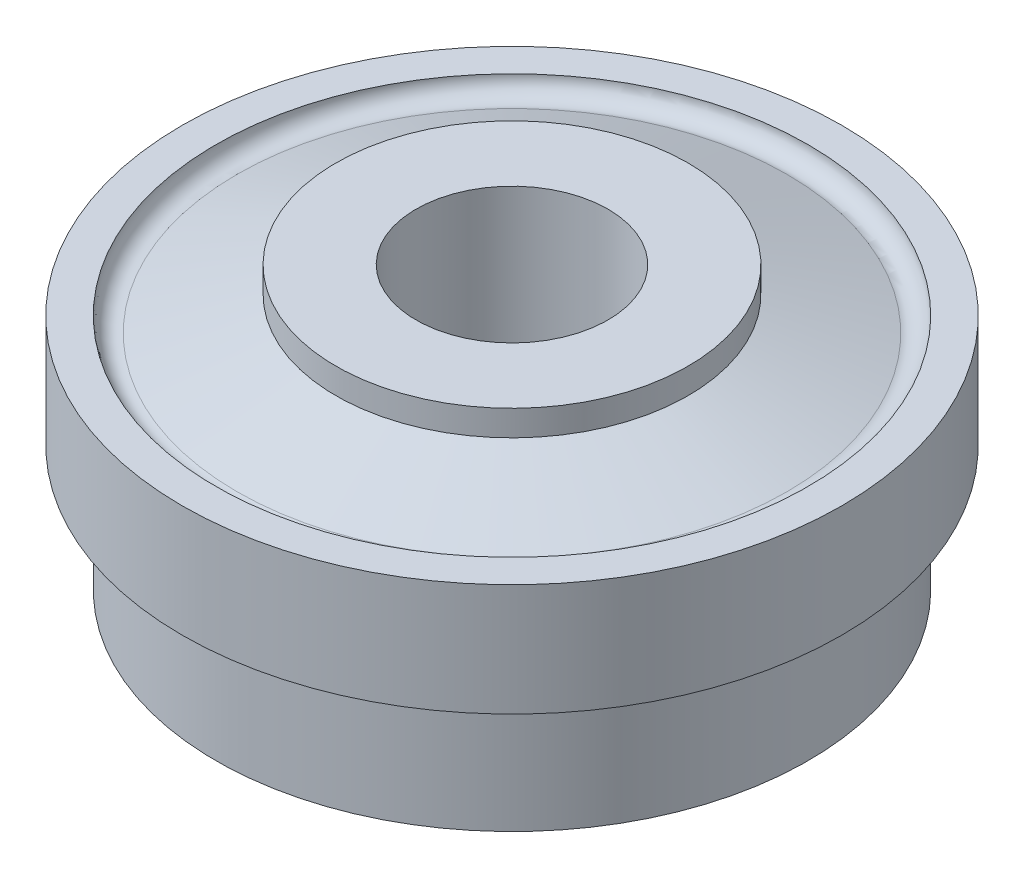
ISO-10303-21;
HEADER;
FILE_DESCRIPTION(('STEP AP214'),'2;1');
FILE_NAME('part.step','',(''),(''),'','','');
FILE_SCHEMA(('AUTOMOTIVE_DESIGN { 1 0 10303 214 1 1 1 1 }'));
ENDSEC;
DATA;
#1=APPLICATION_CONTEXT('core data for automotive mechanical design processes');
#2=APPLICATION_PROTOCOL_DEFINITION('international standard','automotive_design',2000,#1);
#3=PRODUCT_CONTEXT('',#1,'mechanical');
#4=PRODUCT('Part','Part','',(#3));
#5=PRODUCT_RELATED_PRODUCT_CATEGORY('part','',(#4));
#6=PRODUCT_DEFINITION_FORMATION('','',#4);
#7=PRODUCT_DEFINITION_CONTEXT('part definition',#1,'design');
#8=PRODUCT_DEFINITION('design','',#6,#7);
#9=PRODUCT_DEFINITION_SHAPE('','',#8);
#10=(LENGTH_UNIT() NAMED_UNIT(*) SI_UNIT(.MILLI.,.METRE.));
#11=(NAMED_UNIT(*) PLANE_ANGLE_UNIT() SI_UNIT($,.RADIAN.));
#12=(NAMED_UNIT(*) SI_UNIT($,.STERADIAN.) SOLID_ANGLE_UNIT());
#13=UNCERTAINTY_MEASURE_WITH_UNIT(LENGTH_MEASURE(1.E-05),#10,'distance_accuracy_value','');
#14=(GEOMETRIC_REPRESENTATION_CONTEXT(3) GLOBAL_UNCERTAINTY_ASSIGNED_CONTEXT((#13)) GLOBAL_UNIT_ASSIGNED_CONTEXT((#10,
#11,#12)) REPRESENTATION_CONTEXT('',''));
#15=CARTESIAN_POINT('',(0.,0.,0.));
#16=DIRECTION('',(0.,0.,1.));
#17=DIRECTION('',(1.,0.,0.));
#18=AXIS2_PLACEMENT_3D('',#15,#16,#17);
#19=CARTESIAN_POINT('',(0.,45.,0.));
#20=DIRECTION('',(0.,-1.,0.));
#21=DIRECTION('',(0.,0.,-1.));
#22=AXIS2_PLACEMENT_3D('',#19,#20,#21);
#23=TOROIDAL_SURFACE('',#22,61.,6.);
#24=CARTESIAN_POINT('',(0.,45.,0.));
#25=DIRECTION('',(0.,-1.,0.));
#26=DIRECTION('',(0.,0.,-1.));
#27=AXIS2_PLACEMENT_3D('',#24,#25,#26);
#28=CIRCLE('',#27,55.);
#29=CARTESIAN_POINT('',(0.,45.,-55.));
#30=VERTEX_POINT('',#29);
#31=EDGE_CURVE('E82',#30,#30,#28,.T.);
#32=ORIENTED_EDGE('',*,*,#31,.F.);
#33=EDGE_LOOP('',(#32));
#34=FACE_BOUND('',#33,.T.);
#35=CARTESIAN_POINT('',(0.,50.0374747900803,0.));
#36=DIRECTION('',(0.,-1.,0.));
#37=DIRECTION('',(0.,0.,-1.));
#38=AXIS2_PLACEMENT_3D('',#35,#36,#37);
#39=CIRCLE('',#38,64.2594244490869);
#40=CARTESIAN_POINT('',(0.,50.0374747900803,-64.2594244490869));
#41=VERTEX_POINT('',#40);
#42=EDGE_CURVE('E10',#41,#41,#39,.T.);
#43=ORIENTED_EDGE('',*,*,#42,.T.);
#44=EDGE_LOOP('',(#43));
#45=FACE_BOUND('',#44,.T.);
#46=ADVANCED_FACE('F33',(#34,#45),#23,.F.);
#47=CARTESIAN_POINT('',(0.,50.0374747900803,0.));
#48=DIRECTION('',(0.,-1.,0.));
#49=DIRECTION('',(0.,0.,-1.));
#50=AXIS2_PLACEMENT_3D('',#47,#48,#49);
#51=CONICAL_SURFACE('',#50,64.2594244490869,0.996508016861981);
#52=CARTESIAN_POINT('',(0.,35.,0.));
#53=DIRECTION('',(0.,-1.,0.));
#54=DIRECTION('',(0.,0.,-1.));
#55=AXIS2_PLACEMENT_3D('',#52,#53,#54);
#56=CIRCLE('',#55,87.5);
#57=CARTESIAN_POINT('',(0.,35.,-87.5));
#58=VERTEX_POINT('',#57);
#59=EDGE_CURVE('E39',#58,#58,#56,.T.);
#60=ORIENTED_EDGE('',*,*,#59,.T.);
#61=EDGE_LOOP('',(#60));
#62=FACE_BOUND('',#61,.T.);
#63=ORIENTED_EDGE('',*,*,#42,.F.);
#64=EDGE_LOOP('',(#63));
#65=FACE_BOUND('',#64,.T.);
#66=ADVANCED_FACE('F90',(#62,#65),#51,.F.);
#67=CARTESIAN_POINT('',(0.,-19.7924492059413,0.));
#68=DIRECTION('',(0.,-1.,0.));
#69=DIRECTION('',(0.,0.,-1.));
#70=AXIS2_PLACEMENT_3D('',#67,#68,#69);
#71=CYLINDRICAL_SURFACE('',#70,87.5);
#72=CARTESIAN_POINT('',(0.,-12.,0.));
#73=DIRECTION('',(0.,-1.,0.));
#74=DIRECTION('',(0.,0.,-1.));
#75=AXIS2_PLACEMENT_3D('',#72,#73,#74);
#76=CIRCLE('',#75,87.5);
#77=CARTESIAN_POINT('',(0.,-12.,-87.5));
#78=VERTEX_POINT('',#77);
#79=EDGE_CURVE('E43',#78,#78,#76,.T.);
#80=ORIENTED_EDGE('',*,*,#79,.T.);
#81=EDGE_LOOP('',(#80));
#82=FACE_BOUND('',#81,.T.);
#83=ORIENTED_EDGE('',*,*,#59,.F.);
#84=EDGE_LOOP('',(#83));
#85=FACE_BOUND('',#84,.T.);
#86=ADVANCED_FACE('F94',(#82,#85),#71,.F.);
#87=CARTESIAN_POINT('',(0.,-12.,0.));
#88=DIRECTION('',(0.,-1.,0.));
#89=DIRECTION('',(0.,0.,-1.));
#90=AXIS2_PLACEMENT_3D('',#87,#88,#89);
#91=PLANE('',#90);
#92=CARTESIAN_POINT('',(0.,-12.,0.));
#93=DIRECTION('',(0.,-1.,0.));
#94=DIRECTION('',(0.,0.,-1.));
#95=AXIS2_PLACEMENT_3D('',#92,#93,#94);
#96=CIRCLE('',#95,92.5);
#97=CARTESIAN_POINT('',(0.,-12.,-92.5));
#98=VERTEX_POINT('',#97);
#99=EDGE_CURVE('E47',#98,#98,#96,.T.);
#100=ORIENTED_EDGE('',*,*,#99,.T.);
#101=EDGE_LOOP('',(#100));
#102=FACE_BOUND('',#101,.T.);
#103=ORIENTED_EDGE('',*,*,#79,.F.);
#104=EDGE_LOOP('',(#103));
#105=FACE_BOUND('',#104,.T.);
#106=ADVANCED_FACE('F98',(#102,#105),#91,.T.);
#107=CARTESIAN_POINT('',(0.,-19.7924492059413,0.));
#108=DIRECTION('',(0.,-1.,0.));
#109=DIRECTION('',(0.,0.,-1.));
#110=AXIS2_PLACEMENT_3D('',#107,#108,#109);
#111=CYLINDRICAL_SURFACE('',#110,92.5);
#112=CARTESIAN_POINT('',(0.,27.2064154989765,0.));
#113=DIRECTION('',(0.,-1.,0.));
#114=DIRECTION('',(0.,0.,-1.));
#115=AXIS2_PLACEMENT_3D('',#112,#113,#114);
#116=CIRCLE('',#115,92.5);
#117=CARTESIAN_POINT('',(0.,27.2064154989765,-92.5));
#118=VERTEX_POINT('',#117);
#119=EDGE_CURVE('E52',#118,#118,#116,.T.);
#120=ORIENTED_EDGE('',*,*,#119,.T.);
#121=EDGE_LOOP('',(#120));
#122=FACE_BOUND('',#121,.T.);
#123=ORIENTED_EDGE('',*,*,#99,.F.);
#124=EDGE_LOOP('',(#123));
#125=FACE_BOUND('',#124,.T.);
#126=ADVANCED_FACE('F105',(#122,#125),#111,.T.);
#127=CARTESIAN_POINT('',(0.,27.2064154989765,0.));
#128=DIRECTION('',(0.,-1.,0.));
#129=DIRECTION('',(0.,0.,-1.));
#130=AXIS2_PLACEMENT_3D('',#127,#128,#129);
#131=PLANE('',#130);
#132=CARTESIAN_POINT('',(0.,27.2064154989765,0.));
#133=DIRECTION('',(0.,-1.,0.));
#134=DIRECTION('',(0.,0.,-1.));
#135=AXIS2_PLACEMENT_3D('',#132,#133,#134);
#136=CIRCLE('',#135,103.);
#137=CARTESIAN_POINT('',(0.,27.2064154989765,-103.));
#138=VERTEX_POINT('',#137);
#139=EDGE_CURVE('E55',#138,#138,#136,.T.);
#140=ORIENTED_EDGE('',*,*,#139,.T.);
#141=EDGE_LOOP('',(#140));
#142=FACE_BOUND('',#141,.T.);
#143=ORIENTED_EDGE('',*,*,#119,.F.);
#144=EDGE_LOOP('',(#143));
#145=FACE_BOUND('',#144,.T.);
#146=ADVANCED_FACE('F109',(#142,#145),#131,.T.);
#147=CARTESIAN_POINT('',(0.,-19.7924492059413,0.));
#148=DIRECTION('',(0.,-1.,0.));
#149=DIRECTION('',(0.,0.,-1.));
#150=AXIS2_PLACEMENT_3D('',#147,#148,#149);
#151=CYLINDRICAL_SURFACE('',#150,103.);
#152=CARTESIAN_POINT('',(0.,62.2064154989765,0.));
#153=DIRECTION('',(0.,-1.,0.));
#154=DIRECTION('',(0.,0.,-1.));
#155=AXIS2_PLACEMENT_3D('',#152,#153,#154);
#156=CIRCLE('',#155,103.);
#157=CARTESIAN_POINT('',(0.,62.2064154989765,-103.));
#158=VERTEX_POINT('',#157);
#159=EDGE_CURVE('E58',#158,#158,#156,.T.);
#160=ORIENTED_EDGE('',*,*,#159,.T.);
#161=EDGE_LOOP('',(#160));
#162=FACE_BOUND('',#161,.T.);
#163=ORIENTED_EDGE('',*,*,#139,.F.);
#164=EDGE_LOOP('',(#163));
#165=FACE_BOUND('',#164,.T.);
#166=ADVANCED_FACE('F113',(#162,#165),#151,.T.);
#167=CARTESIAN_POINT('',(0.,62.2064154989765,0.));
#168=DIRECTION('',(0.,1.,0.));
#169=DIRECTION('',(0.,0.,1.));
#170=AXIS2_PLACEMENT_3D('',#167,#168,#169);
#171=PLANE('',#170);
#172=CARTESIAN_POINT('',(0.,62.2064154989765,0.));
#173=DIRECTION('',(0.,-1.,0.));
#174=DIRECTION('',(0.,0.,-1.));
#175=AXIS2_PLACEMENT_3D('',#172,#173,#174);
#176=CIRCLE('',#175,92.5000000000001);
#177=CARTESIAN_POINT('',(0.,62.2064154989765,-92.5000000000001));
#178=VERTEX_POINT('',#177);
#179=EDGE_CURVE('E61',#178,#178,#176,.T.);
#180=ORIENTED_EDGE('',*,*,#179,.T.);
#181=EDGE_LOOP('',(#180));
#182=FACE_BOUND('',#181,.T.);
#183=ORIENTED_EDGE('',*,*,#159,.F.);
#184=EDGE_LOOP('',(#183));
#185=FACE_BOUND('',#184,.T.);
#186=ADVANCED_FACE('F117',(#182,#185),#171,.T.);
#187=CARTESIAN_POINT('',(0.,62.2064154989765,0.));
#188=DIRECTION('',(0.,-1.,0.));
#189=DIRECTION('',(0.,0.,-1.));
#190=AXIS2_PLACEMENT_3D('',#187,#188,#189);
#191=TOROIDAL_SURFACE('',#190,87.5000000000001,5.);
#192=ORIENTED_EDGE('',*,*,#179,.F.);
#193=EDGE_LOOP('',(#192));
#194=FACE_BOUND('',#193,.T.);
#195=CARTESIAN_POINT('',(0.,57.47370557926,0.));
#196=DIRECTION('',(0.,-1.,0.));
#197=DIRECTION('',(0.,0.,-1.));
#198=AXIS2_PLACEMENT_3D('',#195,#196,#197);
#199=CIRCLE('',#198,85.8870967741936);
#200=CARTESIAN_POINT('',(0.,57.47370557926,-85.8870967741936));
#201=VERTEX_POINT('',#200);
#202=EDGE_CURVE('E64',#201,#201,#199,.T.);
#203=ORIENTED_EDGE('',*,*,#202,.T.);
#204=EDGE_LOOP('',(#203));
#205=FACE_BOUND('',#204,.T.);
#206=ADVANCED_FACE('F121',(#194,#205),#191,.F.);
#207=CARTESIAN_POINT('',(0.,68.,0.));
#208=DIRECTION('',(0.,-1.,0.));
#209=DIRECTION('',(0.,0.,-1.));
#210=AXIS2_PLACEMENT_3D('',#207,#208,#209);
#211=CONICAL_SURFACE('',#210,55.,1.2423417088646);
#212=ORIENTED_EDGE('',*,*,#202,.F.);
#213=EDGE_LOOP('',(#212));
#214=FACE_BOUND('',#213,.T.);
#215=CARTESIAN_POINT('',(0.,68.,0.));
#216=DIRECTION('',(0.,-1.,0.));
#217=DIRECTION('',(0.,0.,-1.));
#218=AXIS2_PLACEMENT_3D('',#215,#216,#217);
#219=CIRCLE('',#218,55.);
#220=CARTESIAN_POINT('',(0.,68.,-55.));
#221=VERTEX_POINT('',#220);
#222=EDGE_CURVE('E67',#221,#221,#219,.T.);
#223=ORIENTED_EDGE('',*,*,#222,.T.);
#224=EDGE_LOOP('',(#223));
#225=FACE_BOUND('',#224,.T.);
#226=ADVANCED_FACE('F125',(#214,#225),#211,.T.);
#227=CARTESIAN_POINT('',(0.,-19.7924492059413,0.));
#228=DIRECTION('',(0.,-1.,0.));
#229=DIRECTION('',(0.,0.,-1.));
#230=AXIS2_PLACEMENT_3D('',#227,#228,#229);
#231=CYLINDRICAL_SURFACE('',#230,55.);
#232=ORIENTED_EDGE('',*,*,#222,.F.);
#233=EDGE_LOOP('',(#232));
#234=FACE_BOUND('',#233,.T.);
#235=CARTESIAN_POINT('',(0.,76.,0.));
#236=DIRECTION('',(0.,-1.,0.));
#237=DIRECTION('',(0.,0.,-1.));
#238=AXIS2_PLACEMENT_3D('',#235,#236,#237);
#239=CIRCLE('',#238,55.);
#240=CARTESIAN_POINT('',(0.,76.,-55.));
#241=VERTEX_POINT('',#240);
#242=EDGE_CURVE('E70',#241,#241,#239,.T.);
#243=ORIENTED_EDGE('',*,*,#242,.T.);
#244=EDGE_LOOP('',(#243));
#245=FACE_BOUND('',#244,.T.);
#246=ADVANCED_FACE('F129',(#234,#245),#231,.T.);
#247=CARTESIAN_POINT('',(0.,76.,0.));
#248=DIRECTION('',(0.,-1.,0.));
#249=DIRECTION('',(0.,0.,-1.));
#250=AXIS2_PLACEMENT_3D('',#247,#248,#249);
#251=PLANE('',#250);
#252=ORIENTED_EDGE('',*,*,#242,.F.);
#253=EDGE_LOOP('',(#252));
#254=FACE_BOUND('',#253,.T.);
#255=CARTESIAN_POINT('',(0.,76.,0.));
#256=DIRECTION('',(0.,-1.,0.));
#257=DIRECTION('',(0.,0.,-1.));
#258=AXIS2_PLACEMENT_3D('',#255,#256,#257);
#259=CIRCLE('',#258,30.);
#260=CARTESIAN_POINT('',(0.,76.,-30.));
#261=VERTEX_POINT('',#260);
#262=EDGE_CURVE('E73',#261,#261,#259,.T.);
#263=ORIENTED_EDGE('',*,*,#262,.T.);
#264=EDGE_LOOP('',(#263));
#265=FACE_BOUND('',#264,.T.);
#266=ADVANCED_FACE('F133',(#254,#265),#251,.F.);
#267=CARTESIAN_POINT('',(0.,-19.7924492059413,0.));
#268=DIRECTION('',(0.,-1.,0.));
#269=DIRECTION('',(0.,0.,-1.));
#270=AXIS2_PLACEMENT_3D('',#267,#268,#269);
#271=CYLINDRICAL_SURFACE('',#270,30.);
#272=CARTESIAN_POINT('',(0.,0.,0.));
#273=DIRECTION('',(0.,-1.,0.));
#274=DIRECTION('',(0.,0.,-1.));
#275=AXIS2_PLACEMENT_3D('',#272,#273,#274);
#276=CIRCLE('',#275,30.);
#277=CARTESIAN_POINT('',(0.,0.,-30.));
#278=VERTEX_POINT('',#277);
#279=EDGE_CURVE('E76',#278,#278,#276,.T.);
#280=ORIENTED_EDGE('',*,*,#279,.T.);
#281=EDGE_LOOP('',(#280));
#282=FACE_BOUND('',#281,.T.);
#283=ORIENTED_EDGE('',*,*,#262,.F.);
#284=EDGE_LOOP('',(#283));
#285=FACE_BOUND('',#284,.T.);
#286=ADVANCED_FACE('F137',(#282,#285),#271,.F.);
#287=CARTESIAN_POINT('',(0.,0.,0.));
#288=DIRECTION('',(0.,-1.,0.));
#289=DIRECTION('',(0.,0.,-1.));
#290=AXIS2_PLACEMENT_3D('',#287,#288,#289);
#291=PLANE('',#290);
#292=CARTESIAN_POINT('',(0.,0.,0.));
#293=DIRECTION('',(0.,-1.,0.));
#294=DIRECTION('',(0.,0.,-1.));
#295=AXIS2_PLACEMENT_3D('',#292,#293,#294);
#296=CIRCLE('',#295,55.);
#297=CARTESIAN_POINT('',(0.,0.,-55.));
#298=VERTEX_POINT('',#297);
#299=EDGE_CURVE('E79',#298,#298,#296,.T.);
#300=ORIENTED_EDGE('',*,*,#299,.T.);
#301=EDGE_LOOP('',(#300));
#302=FACE_BOUND('',#301,.T.);
#303=ORIENTED_EDGE('',*,*,#279,.F.);
#304=EDGE_LOOP('',(#303));
#305=FACE_BOUND('',#304,.T.);
#306=ADVANCED_FACE('F141',(#302,#305),#291,.T.);
#307=CARTESIAN_POINT('',(0.,-19.7924492059413,0.));
#308=DIRECTION('',(0.,-1.,0.));
#309=DIRECTION('',(0.,0.,-1.));
#310=AXIS2_PLACEMENT_3D('',#307,#308,#309);
#311=CYLINDRICAL_SURFACE('',#310,55.);
#312=ORIENTED_EDGE('',*,*,#31,.T.);
#313=EDGE_LOOP('',(#312));
#314=FACE_BOUND('',#313,.T.);
#315=ORIENTED_EDGE('',*,*,#299,.F.);
#316=EDGE_LOOP('',(#315));
#317=FACE_BOUND('',#316,.T.);
#318=ADVANCED_FACE('F86',(#314,#317),#311,.T.);
#319=CLOSED_SHELL('',(#46,#66,#86,#106,#126,#146,#166,#186,#206,#226,#246,#266,#286,#306,#318));
#320=MANIFOLD_SOLID_BREP('B2',#319);
#321=ADVANCED_BREP_SHAPE_REPRESENTATION('',(#18,#320),#14);
#322=SHAPE_DEFINITION_REPRESENTATION(#9,#321);
ENDSEC;
END-ISO-10303-21;
